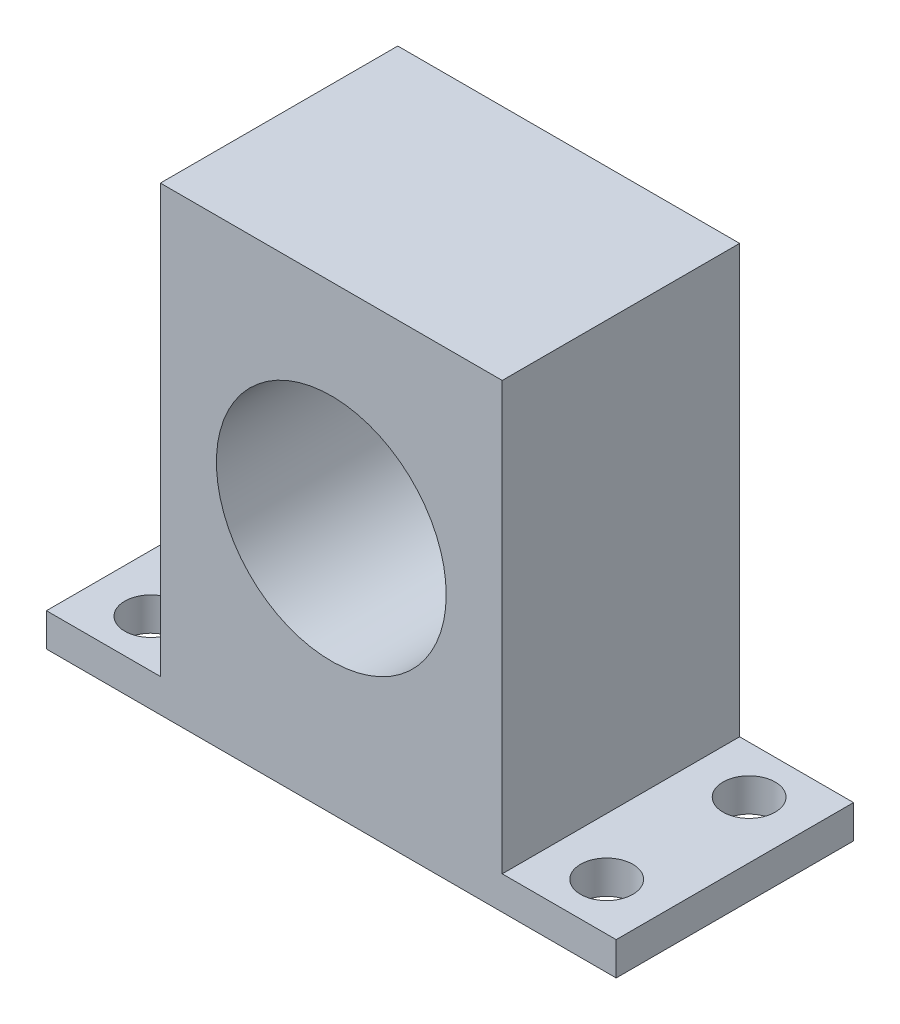
ISO-10303-21;
HEADER;
FILE_DESCRIPTION(('STEP AP214'),'2;1');
FILE_NAME('part.step','',(''),(''),'','','');
FILE_SCHEMA(('AUTOMOTIVE_DESIGN { 1 0 10303 214 1 1 1 1 }'));
ENDSEC;
DATA;
#1=APPLICATION_CONTEXT('core data for automotive mechanical design processes');
#2=APPLICATION_PROTOCOL_DEFINITION('international standard','automotive_design',2000,#1);
#3=PRODUCT_CONTEXT('',#1,'mechanical');
#4=PRODUCT('Part','Part','',(#3));
#5=PRODUCT_RELATED_PRODUCT_CATEGORY('part','',(#4));
#6=PRODUCT_DEFINITION_FORMATION('','',#4);
#7=PRODUCT_DEFINITION_CONTEXT('part definition',#1,'design');
#8=PRODUCT_DEFINITION('design','',#6,#7);
#9=PRODUCT_DEFINITION_SHAPE('','',#8);
#10=(LENGTH_UNIT() NAMED_UNIT(*) SI_UNIT(.MILLI.,.METRE.));
#11=(NAMED_UNIT(*) PLANE_ANGLE_UNIT() SI_UNIT($,.RADIAN.));
#12=(NAMED_UNIT(*) SI_UNIT($,.STERADIAN.) SOLID_ANGLE_UNIT());
#13=UNCERTAINTY_MEASURE_WITH_UNIT(LENGTH_MEASURE(1.E-05),#10,'distance_accuracy_value','');
#14=(GEOMETRIC_REPRESENTATION_CONTEXT(3) GLOBAL_UNCERTAINTY_ASSIGNED_CONTEXT((#13)) GLOBAL_UNIT_ASSIGNED_CONTEXT((#10,
#11,#12)) REPRESENTATION_CONTEXT('',''));
#15=CARTESIAN_POINT('',(0.,0.,0.));
#16=DIRECTION('',(0.,0.,1.));
#17=DIRECTION('',(1.,0.,0.));
#18=AXIS2_PLACEMENT_3D('',#15,#16,#17);
#19=CARTESIAN_POINT('',(0.,0.,12.5));
#20=DIRECTION('',(1.,0.,0.));
#21=DIRECTION('',(0.,0.,-1.));
#22=AXIS2_PLACEMENT_3D('',#19,#20,#21);
#23=PLANE('',#22);
#24=DIRECTION('',(0.,-1.,0.));
#25=VECTOR('',#24,1.);
#26=CARTESIAN_POINT('',(0.,0.,0.));
#27=LINE('',#26,#25);
#28=CARTESIAN_POINT('',(0.,22.5,0.));
#29=VERTEX_POINT('',#28);
#30=CARTESIAN_POINT('',(0.,0.,0.));
#31=VERTEX_POINT('',#30);
#32=EDGE_CURVE('E167',#29,#31,#27,.T.);
#33=ORIENTED_EDGE('',*,*,#32,.T.);
#34=DIRECTION('',(0.,0.,-1.));
#35=VECTOR('',#34,1.);
#36=CARTESIAN_POINT('',(0.,0.,12.5));
#37=LINE('',#36,#35);
#38=CARTESIAN_POINT('',(0.,0.,12.5));
#39=VERTEX_POINT('',#38);
#40=EDGE_CURVE('E13',#39,#31,#37,.T.);
#41=ORIENTED_EDGE('',*,*,#40,.F.);
#42=DIRECTION('',(0.,-1.,0.));
#43=VECTOR('',#42,1.);
#44=CARTESIAN_POINT('',(0.,0.,12.5));
#45=LINE('',#44,#43);
#46=CARTESIAN_POINT('',(0.,22.5,12.5));
#47=VERTEX_POINT('',#46);
#48=EDGE_CURVE('E92',#47,#39,#45,.T.);
#49=ORIENTED_EDGE('',*,*,#48,.F.);
#50=DIRECTION('',(0.,0.,-1.));
#51=VECTOR('',#50,1.);
#52=CARTESIAN_POINT('',(0.,22.5,12.5));
#53=LINE('',#52,#51);
#54=EDGE_CURVE('E176',#47,#29,#53,.T.);
#55=ORIENTED_EDGE('',*,*,#54,.T.);
#56=EDGE_LOOP('',(#33,#41,#49,#55));
#57=FACE_BOUND('',#56,.T.);
#58=ADVANCED_FACE('F50',(#57),#23,.F.);
#59=CARTESIAN_POINT('',(18.,0.,12.5));
#60=DIRECTION('',(-1.,0.,0.));
#61=DIRECTION('',(0.,0.,1.));
#62=AXIS2_PLACEMENT_3D('',#59,#60,#61);
#63=PLANE('',#62);
#64=DIRECTION('',(0.,1.,0.));
#65=VECTOR('',#64,1.);
#66=CARTESIAN_POINT('',(18.,0.,0.));
#67=LINE('',#66,#65);
#68=CARTESIAN_POINT('',(18.,0.,0.));
#69=VERTEX_POINT('',#68);
#70=CARTESIAN_POINT('',(18.,22.5,0.));
#71=VERTEX_POINT('',#70);
#72=EDGE_CURVE('E81',#69,#71,#67,.T.);
#73=ORIENTED_EDGE('',*,*,#72,.T.);
#74=DIRECTION('',(0.,0.,-1.));
#75=VECTOR('',#74,1.);
#76=CARTESIAN_POINT('',(18.,22.5,12.5));
#77=LINE('',#76,#75);
#78=CARTESIAN_POINT('',(18.,22.5,12.5));
#79=VERTEX_POINT('',#78);
#80=EDGE_CURVE('E185',#79,#71,#77,.T.);
#81=ORIENTED_EDGE('',*,*,#80,.F.);
#82=DIRECTION('',(0.,1.,0.));
#83=VECTOR('',#82,1.);
#84=CARTESIAN_POINT('',(18.,0.,12.5));
#85=LINE('',#84,#83);
#86=CARTESIAN_POINT('',(18.,0.,12.5));
#87=VERTEX_POINT('',#86);
#88=EDGE_CURVE('E171',#87,#79,#85,.T.);
#89=ORIENTED_EDGE('',*,*,#88,.F.);
#90=DIRECTION('',(0.,0.,-1.));
#91=VECTOR('',#90,1.);
#92=CARTESIAN_POINT('',(18.,0.,12.5));
#93=LINE('',#92,#91);
#94=EDGE_CURVE('E59',#87,#69,#93,.T.);
#95=ORIENTED_EDGE('',*,*,#94,.T.);
#96=EDGE_LOOP('',(#73,#81,#89,#95));
#97=FACE_BOUND('',#96,.T.);
#98=ADVANCED_FACE('F190',(#97),#63,.F.);
#99=CARTESIAN_POINT('',(0.,22.5,12.5));
#100=DIRECTION('',(0.,-1.,0.));
#101=DIRECTION('',(0.,0.,-1.));
#102=AXIS2_PLACEMENT_3D('',#99,#100,#101);
#103=PLANE('',#102);
#104=DIRECTION('',(-1.,0.,0.));
#105=VECTOR('',#104,1.);
#106=CARTESIAN_POINT('',(0.,22.5,0.));
#107=LINE('',#106,#105);
#108=EDGE_CURVE('E87',#71,#29,#107,.T.);
#109=ORIENTED_EDGE('',*,*,#108,.T.);
#110=ORIENTED_EDGE('',*,*,#54,.F.);
#111=DIRECTION('',(-1.,0.,0.));
#112=VECTOR('',#111,1.);
#113=CARTESIAN_POINT('',(0.,22.5,12.5));
#114=LINE('',#113,#112);
#115=EDGE_CURVE('E67',#79,#47,#114,.T.);
#116=ORIENTED_EDGE('',*,*,#115,.F.);
#117=ORIENTED_EDGE('',*,*,#80,.T.);
#118=EDGE_LOOP('',(#109,#110,#116,#117));
#119=FACE_BOUND('',#118,.T.);
#120=ADVANCED_FACE('F294',(#119),#103,.F.);
#121=CARTESIAN_POINT('',(0.,0.,12.5));
#122=DIRECTION('',(0.,0.,-1.));
#123=DIRECTION('',(-1.,0.,0.));
#124=AXIS2_PLACEMENT_3D('',#121,#122,#123);
#125=PLANE('',#124);
#126=CARTESIAN_POINT('',(9.,11.25,12.5));
#127=DIRECTION('',(0.,0.,1.));
#128=DIRECTION('',(1.,0.,0.));
#129=AXIS2_PLACEMENT_3D('',#126,#127,#128);
#130=CIRCLE('',#129,6.05);
#131=CARTESIAN_POINT('',(15.05,11.25,12.5));
#132=VERTEX_POINT('',#131);
#133=EDGE_CURVE('E153',#132,#132,#130,.T.);
#134=ORIENTED_EDGE('',*,*,#133,.F.);
#135=EDGE_LOOP('',(#134));
#136=FACE_BOUND('',#135,.T.);
#137=ORIENTED_EDGE('',*,*,#48,.T.);
#138=DIRECTION('',(-1.,0.,0.));
#139=VECTOR('',#138,1.);
#140=CARTESIAN_POINT('',(-6.,0.,12.5));
#141=LINE('',#140,#139);
#142=CARTESIAN_POINT('',(-6.,0.,12.5));
#143=VERTEX_POINT('',#142);
#144=EDGE_CURVE('E211',#39,#143,#141,.T.);
#145=ORIENTED_EDGE('',*,*,#144,.T.);
#146=DIRECTION('',(0.,1.,0.));
#147=VECTOR('',#146,1.);
#148=CARTESIAN_POINT('',(-6.,-1.75,12.5));
#149=LINE('',#148,#147);
#150=CARTESIAN_POINT('',(-6.,-1.75,12.5));
#151=VERTEX_POINT('',#150);
#152=EDGE_CURVE('E214',#151,#143,#149,.T.);
#153=ORIENTED_EDGE('',*,*,#152,.F.);
#154=DIRECTION('',(-1.,0.,0.));
#155=VECTOR('',#154,1.);
#156=CARTESIAN_POINT('',(-6.,-1.75,12.5));
#157=LINE('',#156,#155);
#158=CARTESIAN_POINT('',(24.,-1.75,12.5));
#159=VERTEX_POINT('',#158);
#160=EDGE_CURVE('E142',#159,#151,#157,.T.);
#161=ORIENTED_EDGE('',*,*,#160,.F.);
#162=DIRECTION('',(0.,1.,0.));
#163=VECTOR('',#162,1.);
#164=CARTESIAN_POINT('',(24.,-1.75,12.5));
#165=LINE('',#164,#163);
#166=CARTESIAN_POINT('',(24.,0.,12.5));
#167=VERTEX_POINT('',#166);
#168=EDGE_CURVE('E161',#159,#167,#165,.T.);
#169=ORIENTED_EDGE('',*,*,#168,.T.);
#170=EDGE_CURVE('E147',#167,#87,#141,.T.);
#171=ORIENTED_EDGE('',*,*,#170,.T.);
#172=ORIENTED_EDGE('',*,*,#88,.T.);
#173=ORIENTED_EDGE('',*,*,#115,.T.);
#174=EDGE_LOOP('',(#137,#145,#153,#161,#169,#171,#172,#173));
#175=FACE_BOUND('',#174,.T.);
#176=ADVANCED_FACE('F220',(#136,#175),#125,.F.);
#177=CARTESIAN_POINT('',(0.,0.,0.));
#178=DIRECTION('',(0.,0.,-1.));
#179=DIRECTION('',(-1.,0.,0.));
#180=AXIS2_PLACEMENT_3D('',#177,#178,#179);
#181=PLANE('',#180);
#182=CARTESIAN_POINT('',(9.,11.25,0.));
#183=DIRECTION('',(0.,0.,1.));
#184=DIRECTION('',(1.,0.,0.));
#185=AXIS2_PLACEMENT_3D('',#182,#183,#184);
#186=CIRCLE('',#185,6.05);
#187=CARTESIAN_POINT('',(15.05,11.25,0.));
#188=VERTEX_POINT('',#187);
#189=EDGE_CURVE('E159',#188,#188,#186,.T.);
#190=ORIENTED_EDGE('',*,*,#189,.T.);
#191=EDGE_LOOP('',(#190));
#192=FACE_BOUND('',#191,.T.);
#193=ORIENTED_EDGE('',*,*,#32,.F.);
#194=ORIENTED_EDGE('',*,*,#108,.F.);
#195=ORIENTED_EDGE('',*,*,#72,.F.);
#196=DIRECTION('',(1.,0.,0.));
#197=VECTOR('',#196,1.);
#198=CARTESIAN_POINT('',(-6.,0.,0.));
#199=LINE('',#198,#197);
#200=CARTESIAN_POINT('',(24.,0.,0.));
#201=VERTEX_POINT('',#200);
#202=EDGE_CURVE('E195',#69,#201,#199,.T.);
#203=ORIENTED_EDGE('',*,*,#202,.T.);
#204=DIRECTION('',(0.,1.,0.));
#205=VECTOR('',#204,1.);
#206=CARTESIAN_POINT('',(24.,-1.75,0.));
#207=LINE('',#206,#205);
#208=CARTESIAN_POINT('',(24.,-1.75,0.));
#209=VERTEX_POINT('',#208);
#210=EDGE_CURVE('E132',#209,#201,#207,.T.);
#211=ORIENTED_EDGE('',*,*,#210,.F.);
#212=DIRECTION('',(1.,0.,0.));
#213=VECTOR('',#212,1.);
#214=CARTESIAN_POINT('',(-6.,-1.75,0.));
#215=LINE('',#214,#213);
#216=CARTESIAN_POINT('',(-6.,-1.75,0.));
#217=VERTEX_POINT('',#216);
#218=EDGE_CURVE('E123',#217,#209,#215,.T.);
#219=ORIENTED_EDGE('',*,*,#218,.F.);
#220=DIRECTION('',(0.,1.,0.));
#221=VECTOR('',#220,1.);
#222=CARTESIAN_POINT('',(-6.,-1.75,0.));
#223=LINE('',#222,#221);
#224=CARTESIAN_POINT('',(-6.,0.,0.));
#225=VERTEX_POINT('',#224);
#226=EDGE_CURVE('E129',#217,#225,#223,.T.);
#227=ORIENTED_EDGE('',*,*,#226,.T.);
#228=EDGE_CURVE('E200',#225,#31,#199,.T.);
#229=ORIENTED_EDGE('',*,*,#228,.T.);
#230=EDGE_LOOP('',(#193,#194,#195,#203,#211,#219,#227,#229));
#231=FACE_BOUND('',#230,.T.);
#232=ADVANCED_FACE('F126',(#192,#231),#181,.T.);
#233=CARTESIAN_POINT('',(9.,11.25,0.));
#234=DIRECTION('',(0.,0.,1.));
#235=DIRECTION('',(1.,0.,0.));
#236=AXIS2_PLACEMENT_3D('',#233,#234,#235);
#237=CYLINDRICAL_SURFACE('',#236,6.05);
#238=ORIENTED_EDGE('',*,*,#189,.F.);
#239=EDGE_LOOP('',(#238));
#240=FACE_BOUND('',#239,.T.);
#241=ORIENTED_EDGE('',*,*,#133,.T.);
#242=EDGE_LOOP('',(#241));
#243=FACE_BOUND('',#242,.T.);
#244=ADVANCED_FACE('F272',(#240,#243),#237,.F.);
#245=CARTESIAN_POINT('',(0.,0.,0.));
#246=DIRECTION('',(0.,1.,0.));
#247=DIRECTION('',(0.,0.,1.));
#248=AXIS2_PLACEMENT_3D('',#245,#246,#247);
#249=PLANE('',#248);
#250=CARTESIAN_POINT('',(21.,0.,2.5));
#251=DIRECTION('',(0.,1.,0.));
#252=DIRECTION('',(0.,0.,-1.));
#253=AXIS2_PLACEMENT_3D('',#250,#251,#252);
#254=CIRCLE('',#253,1.375);
#255=CARTESIAN_POINT('',(21.,0.,1.125));
#256=VERTEX_POINT('',#255);
#257=EDGE_CURVE('E236',#256,#256,#254,.T.);
#258=ORIENTED_EDGE('',*,*,#257,.F.);
#259=EDGE_LOOP('',(#258));
#260=FACE_BOUND('',#259,.T.);
#261=CARTESIAN_POINT('',(21.,0.,9.99999999999999));
#262=DIRECTION('',(0.,1.,0.));
#263=DIRECTION('',(0.,0.,-1.));
#264=AXIS2_PLACEMENT_3D('',#261,#262,#263);
#265=CIRCLE('',#264,1.375);
#266=CARTESIAN_POINT('',(21.,0.,8.62499999999999));
#267=VERTEX_POINT('',#266);
#268=EDGE_CURVE('E252',#267,#267,#265,.T.);
#269=ORIENTED_EDGE('',*,*,#268,.F.);
#270=EDGE_LOOP('',(#269));
#271=FACE_BOUND('',#270,.T.);
#272=ORIENTED_EDGE('',*,*,#94,.F.);
#273=ORIENTED_EDGE('',*,*,#170,.F.);
#274=DIRECTION('',(0.,0.,1.));
#275=VECTOR('',#274,1.);
#276=CARTESIAN_POINT('',(24.,0.,0.));
#277=LINE('',#276,#275);
#278=EDGE_CURVE('E198',#201,#167,#277,.T.);
#279=ORIENTED_EDGE('',*,*,#278,.F.);
#280=ORIENTED_EDGE('',*,*,#202,.F.);
#281=EDGE_LOOP('',(#272,#273,#279,#280));
#282=FACE_BOUND('',#281,.T.);
#283=ADVANCED_FACE('F197',(#260,#271,#282),#249,.T.);
#284=CARTESIAN_POINT('',(-6.,-1.75,0.));
#285=DIRECTION('',(1.,0.,0.));
#286=DIRECTION('',(0.,0.,-1.));
#287=AXIS2_PLACEMENT_3D('',#284,#285,#286);
#288=PLANE('',#287);
#289=DIRECTION('',(0.,0.,-1.));
#290=VECTOR('',#289,1.);
#291=CARTESIAN_POINT('',(-6.,0.,0.));
#292=LINE('',#291,#290);
#293=EDGE_CURVE('E151',#143,#225,#292,.T.);
#294=ORIENTED_EDGE('',*,*,#293,.T.);
#295=ORIENTED_EDGE('',*,*,#226,.F.);
#296=DIRECTION('',(0.,0.,-1.));
#297=VECTOR('',#296,1.);
#298=CARTESIAN_POINT('',(-6.,-1.75,0.));
#299=LINE('',#298,#297);
#300=EDGE_CURVE('E137',#151,#217,#299,.T.);
#301=ORIENTED_EDGE('',*,*,#300,.F.);
#302=ORIENTED_EDGE('',*,*,#152,.T.);
#303=EDGE_LOOP('',(#294,#295,#301,#302));
#304=FACE_BOUND('',#303,.T.);
#305=ADVANCED_FACE('F149',(#304),#288,.F.);
#306=CARTESIAN_POINT('',(24.,-1.75,0.));
#307=DIRECTION('',(-1.,0.,0.));
#308=DIRECTION('',(0.,0.,1.));
#309=AXIS2_PLACEMENT_3D('',#306,#307,#308);
#310=PLANE('',#309);
#311=ORIENTED_EDGE('',*,*,#278,.T.);
#312=ORIENTED_EDGE('',*,*,#168,.F.);
#313=DIRECTION('',(0.,0.,1.));
#314=VECTOR('',#313,1.);
#315=CARTESIAN_POINT('',(24.,-1.75,0.));
#316=LINE('',#315,#314);
#317=EDGE_CURVE('E136',#209,#159,#316,.T.);
#318=ORIENTED_EDGE('',*,*,#317,.F.);
#319=ORIENTED_EDGE('',*,*,#210,.T.);
#320=EDGE_LOOP('',(#311,#312,#318,#319));
#321=FACE_BOUND('',#320,.T.);
#322=ADVANCED_FACE('F222',(#321),#310,.F.);
#323=CARTESIAN_POINT('',(0.,-1.75,0.));
#324=DIRECTION('',(0.,1.,0.));
#325=DIRECTION('',(0.,0.,1.));
#326=AXIS2_PLACEMENT_3D('',#323,#324,#325);
#327=PLANE('',#326);
#328=CARTESIAN_POINT('',(-3.,-1.75,10.));
#329=DIRECTION('',(0.,1.,0.));
#330=DIRECTION('',(0.,0.,1.));
#331=AXIS2_PLACEMENT_3D('',#328,#329,#330);
#332=CIRCLE('',#331,1.375);
#333=CARTESIAN_POINT('',(-3.,-1.75,11.375));
#334=VERTEX_POINT('',#333);
#335=EDGE_CURVE('E232',#334,#334,#332,.T.);
#336=ORIENTED_EDGE('',*,*,#335,.T.);
#337=EDGE_LOOP('',(#336));
#338=FACE_BOUND('',#337,.T.);
#339=CARTESIAN_POINT('',(21.,-1.75,2.5));
#340=DIRECTION('',(0.,1.,0.));
#341=DIRECTION('',(0.,0.,-1.));
#342=AXIS2_PLACEMENT_3D('',#339,#340,#341);
#343=CIRCLE('',#342,1.375);
#344=CARTESIAN_POINT('',(21.,-1.75,1.125));
#345=VERTEX_POINT('',#344);
#346=EDGE_CURVE('E240',#345,#345,#343,.T.);
#347=ORIENTED_EDGE('',*,*,#346,.T.);
#348=EDGE_LOOP('',(#347));
#349=FACE_BOUND('',#348,.T.);
#350=CARTESIAN_POINT('',(21.,-1.75,9.99999999999999));
#351=DIRECTION('',(0.,1.,0.));
#352=DIRECTION('',(0.,0.,-1.));
#353=AXIS2_PLACEMENT_3D('',#350,#351,#352);
#354=CIRCLE('',#353,1.375);
#355=CARTESIAN_POINT('',(21.,-1.75,8.62499999999999));
#356=VERTEX_POINT('',#355);
#357=EDGE_CURVE('E241',#356,#356,#354,.T.);
#358=ORIENTED_EDGE('',*,*,#357,.T.);
#359=EDGE_LOOP('',(#358));
#360=FACE_BOUND('',#359,.T.);
#361=CARTESIAN_POINT('',(-3.,-1.75,2.5));
#362=DIRECTION('',(0.,1.,0.));
#363=DIRECTION('',(0.,0.,1.));
#364=AXIS2_PLACEMENT_3D('',#361,#362,#363);
#365=CIRCLE('',#364,1.375);
#366=CARTESIAN_POINT('',(-3.,-1.75,3.875));
#367=VERTEX_POINT('',#366);
#368=EDGE_CURVE('E205',#367,#367,#365,.T.);
#369=ORIENTED_EDGE('',*,*,#368,.T.);
#370=EDGE_LOOP('',(#369));
#371=FACE_BOUND('',#370,.T.);
#372=ORIENTED_EDGE('',*,*,#300,.T.);
#373=ORIENTED_EDGE('',*,*,#218,.T.);
#374=ORIENTED_EDGE('',*,*,#317,.T.);
#375=ORIENTED_EDGE('',*,*,#160,.T.);
#376=EDGE_LOOP('',(#372,#373,#374,#375));
#377=FACE_BOUND('',#376,.T.);
#378=ADVANCED_FACE('F140',(#338,#349,#360,#371,#377),#327,.F.);
#379=CARTESIAN_POINT('',(-3.,0.,10.));
#380=DIRECTION('',(0.,1.,0.));
#381=DIRECTION('',(0.,0.,1.));
#382=AXIS2_PLACEMENT_3D('',#379,#380,#381);
#383=CIRCLE('',#382,1.375);
#384=CARTESIAN_POINT('',(-3.,0.,11.375));
#385=VERTEX_POINT('',#384);
#386=EDGE_CURVE('E245',#385,#385,#383,.T.);
#387=ORIENTED_EDGE('',*,*,#386,.F.);
#388=EDGE_LOOP('',(#387));
#389=FACE_BOUND('',#388,.T.);
#390=CARTESIAN_POINT('',(-3.,0.,2.5));
#391=DIRECTION('',(0.,1.,0.));
#392=DIRECTION('',(0.,0.,1.));
#393=AXIS2_PLACEMENT_3D('',#390,#391,#392);
#394=CIRCLE('',#393,1.375);
#395=CARTESIAN_POINT('',(-3.,0.,3.875));
#396=VERTEX_POINT('',#395);
#397=EDGE_CURVE('E228',#396,#396,#394,.T.);
#398=ORIENTED_EDGE('',*,*,#397,.F.);
#399=EDGE_LOOP('',(#398));
#400=FACE_BOUND('',#399,.T.);
#401=ORIENTED_EDGE('',*,*,#144,.F.);
#402=ORIENTED_EDGE('',*,*,#40,.T.);
#403=ORIENTED_EDGE('',*,*,#228,.F.);
#404=ORIENTED_EDGE('',*,*,#293,.F.);
#405=EDGE_LOOP('',(#401,#402,#403,#404));
#406=FACE_BOUND('',#405,.T.);
#407=ADVANCED_FACE('F275',(#389,#400,#406),#249,.T.);
#408=CARTESIAN_POINT('',(-3.,-1.75,2.5));
#409=DIRECTION('',(0.,1.,0.));
#410=DIRECTION('',(0.,0.,1.));
#411=AXIS2_PLACEMENT_3D('',#408,#409,#410);
#412=CYLINDRICAL_SURFACE('',#411,1.375);
#413=ORIENTED_EDGE('',*,*,#368,.F.);
#414=EDGE_LOOP('',(#413));
#415=FACE_BOUND('',#414,.T.);
#416=ORIENTED_EDGE('',*,*,#397,.T.);
#417=EDGE_LOOP('',(#416));
#418=FACE_BOUND('',#417,.T.);
#419=ADVANCED_FACE('F287',(#415,#418),#412,.F.);
#420=CARTESIAN_POINT('',(-3.,-1.75,10.));
#421=DIRECTION('',(0.,1.,0.));
#422=DIRECTION('',(0.,0.,1.));
#423=AXIS2_PLACEMENT_3D('',#420,#421,#422);
#424=CYLINDRICAL_SURFACE('',#423,1.375);
#425=ORIENTED_EDGE('',*,*,#335,.F.);
#426=EDGE_LOOP('',(#425));
#427=FACE_BOUND('',#426,.T.);
#428=ORIENTED_EDGE('',*,*,#386,.T.);
#429=EDGE_LOOP('',(#428));
#430=FACE_BOUND('',#429,.T.);
#431=ADVANCED_FACE('F267',(#427,#430),#424,.F.);
#432=CARTESIAN_POINT('',(21.,-1.75,9.99999999999999));
#433=DIRECTION('',(0.,1.,0.));
#434=DIRECTION('',(0.,0.,1.));
#435=AXIS2_PLACEMENT_3D('',#432,#433,#434);
#436=CYLINDRICAL_SURFACE('',#435,1.375);
#437=ORIENTED_EDGE('',*,*,#357,.F.);
#438=EDGE_LOOP('',(#437));
#439=FACE_BOUND('',#438,.T.);
#440=ORIENTED_EDGE('',*,*,#268,.T.);
#441=EDGE_LOOP('',(#440));
#442=FACE_BOUND('',#441,.T.);
#443=ADVANCED_FACE('F263',(#439,#442),#436,.F.);
#444=CARTESIAN_POINT('',(21.,-1.75,2.5));
#445=DIRECTION('',(0.,1.,0.));
#446=DIRECTION('',(0.,0.,1.));
#447=AXIS2_PLACEMENT_3D('',#444,#445,#446);
#448=CYLINDRICAL_SURFACE('',#447,1.375);
#449=ORIENTED_EDGE('',*,*,#346,.F.);
#450=EDGE_LOOP('',(#449));
#451=FACE_BOUND('',#450,.T.);
#452=ORIENTED_EDGE('',*,*,#257,.T.);
#453=EDGE_LOOP('',(#452));
#454=FACE_BOUND('',#453,.T.);
#455=ADVANCED_FACE('F266',(#451,#454),#448,.F.);
#456=CLOSED_SHELL('',(#58,#98,#120,#176,#232,#244,#283,#305,#322,#378,#407,#419,#431,#443,#455));
#457=MANIFOLD_SOLID_BREP('B2',#456);
#458=ADVANCED_BREP_SHAPE_REPRESENTATION('',(#18,#457),#14);
#459=SHAPE_DEFINITION_REPRESENTATION(#9,#458);
ENDSEC;
END-ISO-10303-21;
